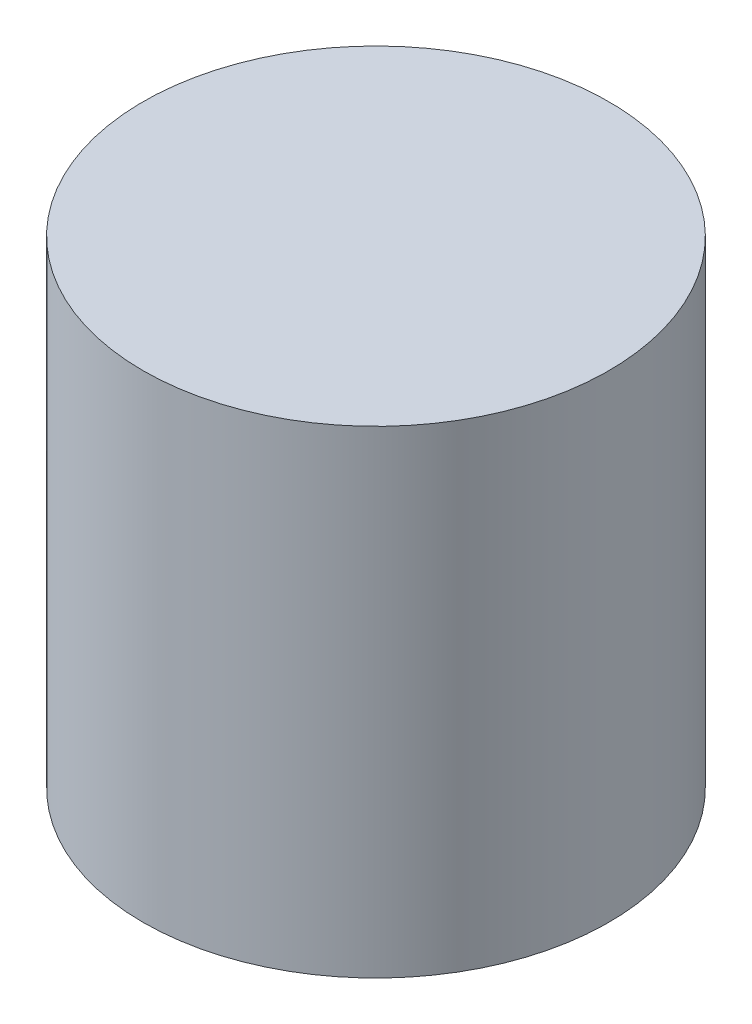
ISO-10303-21;
HEADER;
FILE_DESCRIPTION(('STEP AP214'),'2;1');
FILE_NAME('part.step','',(''),(''),'','','');
FILE_SCHEMA(('AUTOMOTIVE_DESIGN { 1 0 10303 214 1 1 1 1 }'));
ENDSEC;
DATA;
#1=APPLICATION_CONTEXT('core data for automotive mechanical design processes');
#2=APPLICATION_PROTOCOL_DEFINITION('international standard','automotive_design',2000,#1);
#3=PRODUCT_CONTEXT('',#1,'mechanical');
#4=PRODUCT('Part','Part','',(#3));
#5=PRODUCT_RELATED_PRODUCT_CATEGORY('part','',(#4));
#6=PRODUCT_DEFINITION_FORMATION('','',#4);
#7=PRODUCT_DEFINITION_CONTEXT('part definition',#1,'design');
#8=PRODUCT_DEFINITION('design','',#6,#7);
#9=PRODUCT_DEFINITION_SHAPE('','',#8);
#10=(LENGTH_UNIT() NAMED_UNIT(*) SI_UNIT(.MILLI.,.METRE.));
#11=(NAMED_UNIT(*) PLANE_ANGLE_UNIT() SI_UNIT($,.RADIAN.));
#12=(NAMED_UNIT(*) SI_UNIT($,.STERADIAN.) SOLID_ANGLE_UNIT());
#13=UNCERTAINTY_MEASURE_WITH_UNIT(LENGTH_MEASURE(1.E-05),#10,'distance_accuracy_value','');
#14=(GEOMETRIC_REPRESENTATION_CONTEXT(3) GLOBAL_UNCERTAINTY_ASSIGNED_CONTEXT((#13)) GLOBAL_UNIT_ASSIGNED_CONTEXT((#10,
#11,#12)) REPRESENTATION_CONTEXT('',''));
#15=CARTESIAN_POINT('',(0.,0.,0.));
#16=DIRECTION('',(0.,0.,1.));
#17=DIRECTION('',(1.,0.,0.));
#18=AXIS2_PLACEMENT_3D('',#15,#16,#17);
#19=CARTESIAN_POINT('',(0.,20.,0.));
#20=DIRECTION('',(0.,-1.,0.));
#21=DIRECTION('',(0.,0.,-1.));
#22=AXIS2_PLACEMENT_3D('',#19,#20,#21);
#23=CYLINDRICAL_SURFACE('',#22,9.75);
#24=CARTESIAN_POINT('',(0.,20.,0.));
#25=DIRECTION('',(0.,1.,0.));
#26=DIRECTION('',(0.,0.,1.));
#27=AXIS2_PLACEMENT_3D('',#24,#25,#26);
#28=CIRCLE('',#27,9.75);
#29=CARTESIAN_POINT('',(0.,20.,9.75));
#30=VERTEX_POINT('',#29);
#31=EDGE_CURVE('E10',#30,#30,#28,.T.);
#32=ORIENTED_EDGE('',*,*,#31,.F.);
#33=EDGE_LOOP('',(#32));
#34=FACE_BOUND('',#33,.T.);
#35=CARTESIAN_POINT('',(0.,0.,0.));
#36=DIRECTION('',(0.,1.,0.));
#37=DIRECTION('',(0.,0.,1.));
#38=AXIS2_PLACEMENT_3D('',#35,#36,#37);
#39=CIRCLE('',#38,9.75);
#40=CARTESIAN_POINT('',(0.,0.,9.75));
#41=VERTEX_POINT('',#40);
#42=EDGE_CURVE('E37',#41,#41,#39,.T.);
#43=ORIENTED_EDGE('',*,*,#42,.T.);
#44=EDGE_LOOP('',(#43));
#45=FACE_BOUND('',#44,.T.);
#46=ADVANCED_FACE('F34',(#34,#45),#23,.T.);
#47=CARTESIAN_POINT('',(0.,20.,0.));
#48=DIRECTION('',(0.,1.,0.));
#49=DIRECTION('',(0.,0.,1.));
#50=AXIS2_PLACEMENT_3D('',#47,#48,#49);
#51=PLANE('',#50);
#52=ORIENTED_EDGE('',*,*,#31,.T.);
#53=EDGE_LOOP('',(#52));
#54=FACE_BOUND('',#53,.T.);
#55=ADVANCED_FACE('F49',(#54),#51,.T.);
#56=CARTESIAN_POINT('',(0.,0.,0.));
#57=DIRECTION('',(0.,1.,0.));
#58=DIRECTION('',(0.,0.,1.));
#59=AXIS2_PLACEMENT_3D('',#56,#57,#58);
#60=PLANE('',#59);
#61=ORIENTED_EDGE('',*,*,#42,.F.);
#62=EDGE_LOOP('',(#61));
#63=FACE_BOUND('',#62,.T.);
#64=ADVANCED_FACE('F47',(#63),#60,.F.);
#65=CLOSED_SHELL('',(#46,#55,#64));
#66=MANIFOLD_SOLID_BREP('B2',#65);
#67=ADVANCED_BREP_SHAPE_REPRESENTATION('',(#18,#66),#14);
#68=SHAPE_DEFINITION_REPRESENTATION(#9,#67);
ENDSEC;
END-ISO-10303-21;
